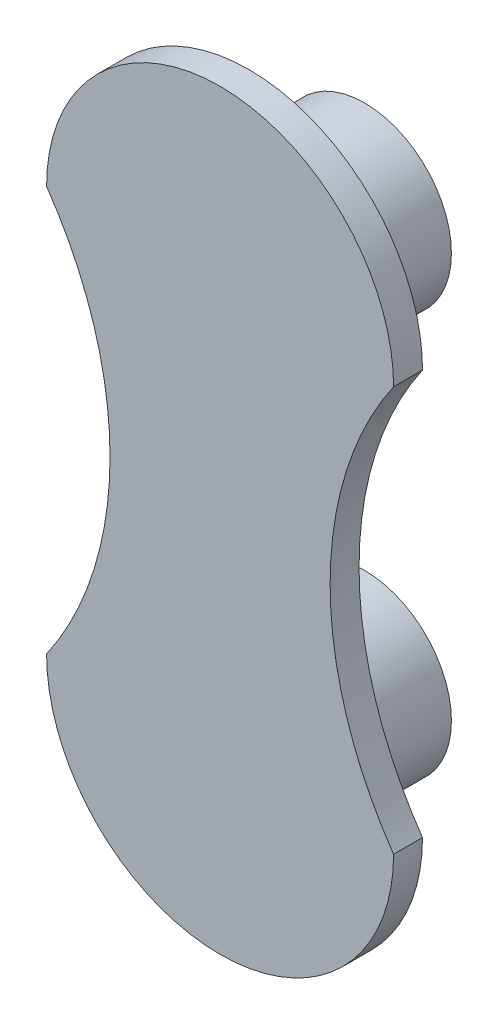
ISO-10303-21;
HEADER;
FILE_DESCRIPTION(('STEP AP214'),'2;1');
FILE_NAME('part.step','',(''),(''),'','','');
FILE_SCHEMA(('AUTOMOTIVE_DESIGN { 1 0 10303 214 1 1 1 1 }'));
ENDSEC;
DATA;
#1=APPLICATION_CONTEXT('core data for automotive mechanical design processes');
#2=APPLICATION_PROTOCOL_DEFINITION('international standard','automotive_design',2000,#1);
#3=PRODUCT_CONTEXT('',#1,'mechanical');
#4=PRODUCT('Part','Part','',(#3));
#5=PRODUCT_RELATED_PRODUCT_CATEGORY('part','',(#4));
#6=PRODUCT_DEFINITION_FORMATION('','',#4);
#7=PRODUCT_DEFINITION_CONTEXT('part definition',#1,'design');
#8=PRODUCT_DEFINITION('design','',#6,#7);
#9=PRODUCT_DEFINITION_SHAPE('','',#8);
#10=(LENGTH_UNIT() NAMED_UNIT(*) SI_UNIT(.MILLI.,.METRE.));
#11=(NAMED_UNIT(*) PLANE_ANGLE_UNIT() SI_UNIT($,.RADIAN.));
#12=(NAMED_UNIT(*) SI_UNIT($,.STERADIAN.) SOLID_ANGLE_UNIT());
#13=UNCERTAINTY_MEASURE_WITH_UNIT(LENGTH_MEASURE(1.E-05),#10,'distance_accuracy_value','');
#14=(GEOMETRIC_REPRESENTATION_CONTEXT(3) GLOBAL_UNCERTAINTY_ASSIGNED_CONTEXT((#13)) GLOBAL_UNIT_ASSIGNED_CONTEXT((#10,
#11,#12)) REPRESENTATION_CONTEXT('',''));
#15=CARTESIAN_POINT('',(0.,0.,0.));
#16=DIRECTION('',(0.,0.,1.));
#17=DIRECTION('',(1.,0.,0.));
#18=AXIS2_PLACEMENT_3D('',#15,#16,#17);
#19=CARTESIAN_POINT('',(102.033510991184,14.7204545454546,6.35));
#20=DIRECTION('',(0.,0.,-1.));
#21=DIRECTION('',(-1.,0.,0.));
#22=AXIS2_PLACEMENT_3D('',#19,#20,#21);
#23=CYLINDRICAL_SURFACE('',#22,77.8671710521186);
#24=CARTESIAN_POINT('',(102.033510991184,14.7204545454546,0.));
#25=DIRECTION('',(0.,0.,-1.));
#26=DIRECTION('',(1.,0.,0.));
#27=AXIS2_PLACEMENT_3D('',#24,#25,#26);
#28=CIRCLE('',#27,77.8671710521186);
#29=CARTESIAN_POINT('',(38.1,-29.7295454545454,0.));
#30=VERTEX_POINT('',#29);
#31=CARTESIAN_POINT('',(38.1,59.1704545454546,0.));
#32=VERTEX_POINT('',#31);
#33=EDGE_CURVE('E100',#30,#32,#28,.T.);
#34=ORIENTED_EDGE('',*,*,#33,.T.);
#35=DIRECTION('',(0.,0.,-1.));
#36=VECTOR('',#35,1.);
#37=CARTESIAN_POINT('',(38.1,59.1704545454546,6.35));
#38=LINE('',#37,#36);
#39=CARTESIAN_POINT('',(38.1,59.1704545454546,6.35));
#40=VERTEX_POINT('',#39);
#41=EDGE_CURVE('E91',#40,#32,#38,.T.);
#42=ORIENTED_EDGE('',*,*,#41,.F.);
#43=CARTESIAN_POINT('',(102.033510991184,14.7204545454546,6.35));
#44=DIRECTION('',(0.,0.,-1.));
#45=DIRECTION('',(1.,0.,0.));
#46=AXIS2_PLACEMENT_3D('',#43,#44,#45);
#47=CIRCLE('',#46,77.8671710521186);
#48=CARTESIAN_POINT('',(38.1,-29.7295454545454,6.35));
#49=VERTEX_POINT('',#48);
#50=EDGE_CURVE('E85',#49,#40,#47,.T.);
#51=ORIENTED_EDGE('',*,*,#50,.F.);
#52=DIRECTION('',(0.,0.,-1.));
#53=VECTOR('',#52,1.);
#54=CARTESIAN_POINT('',(38.1,-29.7295454545454,6.35));
#55=LINE('',#54,#53);
#56=EDGE_CURVE('E96',#49,#30,#55,.T.);
#57=ORIENTED_EDGE('',*,*,#56,.T.);
#58=EDGE_LOOP('',(#34,#42,#51,#57));
#59=FACE_BOUND('',#58,.T.);
#60=ADVANCED_FACE('F33',(#59),#23,.F.);
#61=CARTESIAN_POINT('',(0.,59.1704545454546,6.35));
#62=DIRECTION('',(0.,0.,-1.));
#63=DIRECTION('',(-1.,0.,0.));
#64=AXIS2_PLACEMENT_3D('',#61,#62,#63);
#65=CYLINDRICAL_SURFACE('',#64,38.1);
#66=CARTESIAN_POINT('',(0.,59.1704545454546,0.));
#67=DIRECTION('',(0.,0.,1.));
#68=DIRECTION('',(1.,0.,0.));
#69=AXIS2_PLACEMENT_3D('',#66,#67,#68);
#70=CIRCLE('',#69,38.1);
#71=CARTESIAN_POINT('',(-38.1,59.1704545454546,0.));
#72=VERTEX_POINT('',#71);
#73=EDGE_CURVE('E90',#32,#72,#70,.T.);
#74=ORIENTED_EDGE('',*,*,#73,.T.);
#75=DIRECTION('',(0.,0.,-1.));
#76=VECTOR('',#75,1.);
#77=CARTESIAN_POINT('',(-38.1,59.1704545454546,6.35));
#78=LINE('',#77,#76);
#79=CARTESIAN_POINT('',(-38.1,59.1704545454546,6.35));
#80=VERTEX_POINT('',#79);
#81=EDGE_CURVE('E88',#80,#72,#78,.T.);
#82=ORIENTED_EDGE('',*,*,#81,.F.);
#83=CARTESIAN_POINT('',(0.,59.1704545454546,6.35));
#84=DIRECTION('',(0.,0.,1.));
#85=DIRECTION('',(1.,0.,0.));
#86=AXIS2_PLACEMENT_3D('',#83,#84,#85);
#87=CIRCLE('',#86,38.1);
#88=EDGE_CURVE('E80',#40,#80,#87,.T.);
#89=ORIENTED_EDGE('',*,*,#88,.F.);
#90=ORIENTED_EDGE('',*,*,#41,.T.);
#91=EDGE_LOOP('',(#74,#82,#89,#90));
#92=FACE_BOUND('',#91,.T.);
#93=ADVANCED_FACE('F89',(#92),#65,.T.);
#94=CARTESIAN_POINT('',(-102.033510991184,14.7204545454546,6.35));
#95=DIRECTION('',(0.,0.,-1.));
#96=DIRECTION('',(-1.,0.,0.));
#97=AXIS2_PLACEMENT_3D('',#94,#95,#96);
#98=CYLINDRICAL_SURFACE('',#97,77.8671710521186);
#99=CARTESIAN_POINT('',(-102.033510991184,14.7204545454546,0.));
#100=DIRECTION('',(0.,0.,-1.));
#101=DIRECTION('',(-1.,0.,0.));
#102=AXIS2_PLACEMENT_3D('',#99,#100,#101);
#103=CIRCLE('',#102,77.8671710521186);
#104=CARTESIAN_POINT('',(-38.1,-29.7295454545454,0.));
#105=VERTEX_POINT('',#104);
#106=EDGE_CURVE('E66',#72,#105,#103,.T.);
#107=ORIENTED_EDGE('',*,*,#106,.T.);
#108=DIRECTION('',(0.,0.,-1.));
#109=VECTOR('',#108,1.);
#110=CARTESIAN_POINT('',(-38.1,-29.7295454545454,6.35));
#111=LINE('',#110,#109);
#112=CARTESIAN_POINT('',(-38.1,-29.7295454545454,6.35));
#113=VERTEX_POINT('',#112);
#114=EDGE_CURVE('E92',#113,#105,#111,.T.);
#115=ORIENTED_EDGE('',*,*,#114,.F.);
#116=CARTESIAN_POINT('',(-102.033510991184,14.7204545454546,6.35));
#117=DIRECTION('',(0.,0.,-1.));
#118=DIRECTION('',(-1.,0.,0.));
#119=AXIS2_PLACEMENT_3D('',#116,#117,#118);
#120=CIRCLE('',#119,77.8671710521186);
#121=EDGE_CURVE('E83',#80,#113,#120,.T.);
#122=ORIENTED_EDGE('',*,*,#121,.F.);
#123=ORIENTED_EDGE('',*,*,#81,.T.);
#124=EDGE_LOOP('',(#107,#115,#122,#123));
#125=FACE_BOUND('',#124,.T.);
#126=ADVANCED_FACE('F94',(#125),#98,.F.);
#127=CARTESIAN_POINT('',(0.,-29.7295454545454,6.35));
#128=DIRECTION('',(0.,0.,-1.));
#129=DIRECTION('',(-1.,0.,0.));
#130=AXIS2_PLACEMENT_3D('',#127,#128,#129);
#131=CYLINDRICAL_SURFACE('',#130,38.1);
#132=CARTESIAN_POINT('',(0.,-29.7295454545454,0.));
#133=DIRECTION('',(0.,0.,1.));
#134=DIRECTION('',(1.,0.,0.));
#135=AXIS2_PLACEMENT_3D('',#132,#133,#134);
#136=CIRCLE('',#135,38.1);
#137=EDGE_CURVE('E72',#105,#30,#136,.T.);
#138=ORIENTED_EDGE('',*,*,#137,.T.);
#139=ORIENTED_EDGE('',*,*,#56,.F.);
#140=CARTESIAN_POINT('',(0.,-29.7295454545454,6.35));
#141=DIRECTION('',(0.,0.,1.));
#142=DIRECTION('',(1.,0.,0.));
#143=AXIS2_PLACEMENT_3D('',#140,#141,#142);
#144=CIRCLE('',#143,38.1);
#145=EDGE_CURVE('E49',#113,#49,#144,.T.);
#146=ORIENTED_EDGE('',*,*,#145,.F.);
#147=ORIENTED_EDGE('',*,*,#114,.T.);
#148=EDGE_LOOP('',(#138,#139,#146,#147));
#149=FACE_BOUND('',#148,.T.);
#150=ADVANCED_FACE('F121',(#149),#131,.T.);
#151=CARTESIAN_POINT('',(51.0167554955922,-7.50454545454542,6.35));
#152=DIRECTION('',(0.,0.,1.));
#153=DIRECTION('',(1.,0.,0.));
#154=AXIS2_PLACEMENT_3D('',#151,#152,#153);
#155=PLANE('',#154);
#156=ORIENTED_EDGE('',*,*,#50,.T.);
#157=ORIENTED_EDGE('',*,*,#88,.T.);
#158=ORIENTED_EDGE('',*,*,#121,.T.);
#159=ORIENTED_EDGE('',*,*,#145,.T.);
#160=EDGE_LOOP('',(#156,#157,#158,#159));
#161=FACE_BOUND('',#160,.T.);
#162=ADVANCED_FACE('F81',(#161),#155,.T.);
#163=CARTESIAN_POINT('',(51.0167554955922,-7.50454545454542,0.));
#164=DIRECTION('',(0.,0.,1.));
#165=DIRECTION('',(1.,0.,0.));
#166=AXIS2_PLACEMENT_3D('',#163,#164,#165);
#167=PLANE('',#166);
#168=CARTESIAN_POINT('',(0.,-29.7295454545454,0.));
#169=DIRECTION('',(0.,0.,1.));
#170=DIRECTION('',(1.,0.,0.));
#171=AXIS2_PLACEMENT_3D('',#168,#169,#170);
#172=CIRCLE('',#171,19.05);
#173=CARTESIAN_POINT('',(19.05,-29.7295454545454,0.));
#174=VERTEX_POINT('',#173);
#175=EDGE_CURVE('E11',#174,#174,#172,.F.);
#176=ORIENTED_EDGE('',*,*,#175,.F.);
#177=EDGE_LOOP('',(#176));
#178=FACE_BOUND('',#177,.T.);
#179=CARTESIAN_POINT('',(0.,59.1704545454546,0.));
#180=DIRECTION('',(0.,0.,1.));
#181=DIRECTION('',(1.,0.,0.));
#182=AXIS2_PLACEMENT_3D('',#179,#180,#181);
#183=CIRCLE('',#182,19.05);
#184=CARTESIAN_POINT('',(19.05,59.1704545454546,0.));
#185=VERTEX_POINT('',#184);
#186=EDGE_CURVE('E41',#185,#185,#183,.F.);
#187=ORIENTED_EDGE('',*,*,#186,.F.);
#188=EDGE_LOOP('',(#187));
#189=FACE_BOUND('',#188,.T.);
#190=ORIENTED_EDGE('',*,*,#33,.F.);
#191=ORIENTED_EDGE('',*,*,#137,.F.);
#192=ORIENTED_EDGE('',*,*,#106,.F.);
#193=ORIENTED_EDGE('',*,*,#73,.F.);
#194=EDGE_LOOP('',(#190,#191,#192,#193));
#195=FACE_BOUND('',#194,.T.);
#196=ADVANCED_FACE('F114',(#178,#189,#195),#167,.F.);
#197=CARTESIAN_POINT('',(0.,59.1704545454546,-25.4));
#198=DIRECTION('',(0.,0.,1.));
#199=DIRECTION('',(1.,0.,0.));
#200=AXIS2_PLACEMENT_3D('',#197,#198,#199);
#201=CYLINDRICAL_SURFACE('',#200,19.05);
#202=CARTESIAN_POINT('',(0.,59.1704545454546,-25.4));
#203=DIRECTION('',(0.,0.,-1.));
#204=DIRECTION('',(-1.,0.,0.));
#205=AXIS2_PLACEMENT_3D('',#202,#203,#204);
#206=CIRCLE('',#205,19.05);
#207=CARTESIAN_POINT('',(-19.05,59.1704545454546,-25.4));
#208=VERTEX_POINT('',#207);
#209=EDGE_CURVE('E103',#208,#208,#206,.T.);
#210=ORIENTED_EDGE('',*,*,#209,.F.);
#211=EDGE_LOOP('',(#210));
#212=FACE_BOUND('',#211,.T.);
#213=ORIENTED_EDGE('',*,*,#186,.T.);
#214=EDGE_LOOP('',(#213));
#215=FACE_BOUND('',#214,.T.);
#216=ADVANCED_FACE('F112',(#212,#215),#201,.T.);
#217=CARTESIAN_POINT('',(0.,59.1704545454546,-25.4));
#218=DIRECTION('',(0.,0.,-1.));
#219=DIRECTION('',(-1.,0.,0.));
#220=AXIS2_PLACEMENT_3D('',#217,#218,#219);
#221=PLANE('',#220);
#222=ORIENTED_EDGE('',*,*,#209,.T.);
#223=EDGE_LOOP('',(#222));
#224=FACE_BOUND('',#223,.T.);
#225=ADVANCED_FACE('F165',(#224),#221,.T.);
#226=CARTESIAN_POINT('',(0.,-29.7295454545454,-25.4));
#227=DIRECTION('',(0.,0.,1.));
#228=DIRECTION('',(1.,0.,0.));
#229=AXIS2_PLACEMENT_3D('',#226,#227,#228);
#230=CYLINDRICAL_SURFACE('',#229,19.05);
#231=CARTESIAN_POINT('',(0.,-29.7295454545454,-25.4));
#232=DIRECTION('',(0.,0.,-1.));
#233=DIRECTION('',(-1.,0.,0.));
#234=AXIS2_PLACEMENT_3D('',#231,#232,#233);
#235=CIRCLE('',#234,19.05);
#236=CARTESIAN_POINT('',(-19.05,-29.7295454545454,-25.4));
#237=VERTEX_POINT('',#236);
#238=EDGE_CURVE('E201',#237,#237,#235,.T.);
#239=ORIENTED_EDGE('',*,*,#238,.F.);
#240=EDGE_LOOP('',(#239));
#241=FACE_BOUND('',#240,.T.);
#242=ORIENTED_EDGE('',*,*,#175,.T.);
#243=EDGE_LOOP('',(#242));
#244=FACE_BOUND('',#243,.T.);
#245=ADVANCED_FACE('F175',(#241,#244),#230,.T.);
#246=CARTESIAN_POINT('',(0.,-29.7295454545454,-25.4));
#247=DIRECTION('',(0.,0.,-1.));
#248=DIRECTION('',(-1.,0.,0.));
#249=AXIS2_PLACEMENT_3D('',#246,#247,#248);
#250=PLANE('',#249);
#251=ORIENTED_EDGE('',*,*,#238,.T.);
#252=EDGE_LOOP('',(#251));
#253=FACE_BOUND('',#252,.T.);
#254=ADVANCED_FACE('F185',(#253),#250,.T.);
#255=CLOSED_SHELL('',(#60,#93,#126,#150,#162,#196,#216,#225,#245,#254));
#256=MANIFOLD_SOLID_BREP('B2',#255);
#257=ADVANCED_BREP_SHAPE_REPRESENTATION('',(#18,#256),#14);
#258=SHAPE_DEFINITION_REPRESENTATION(#9,#257);
ENDSEC;
END-ISO-10303-21;
